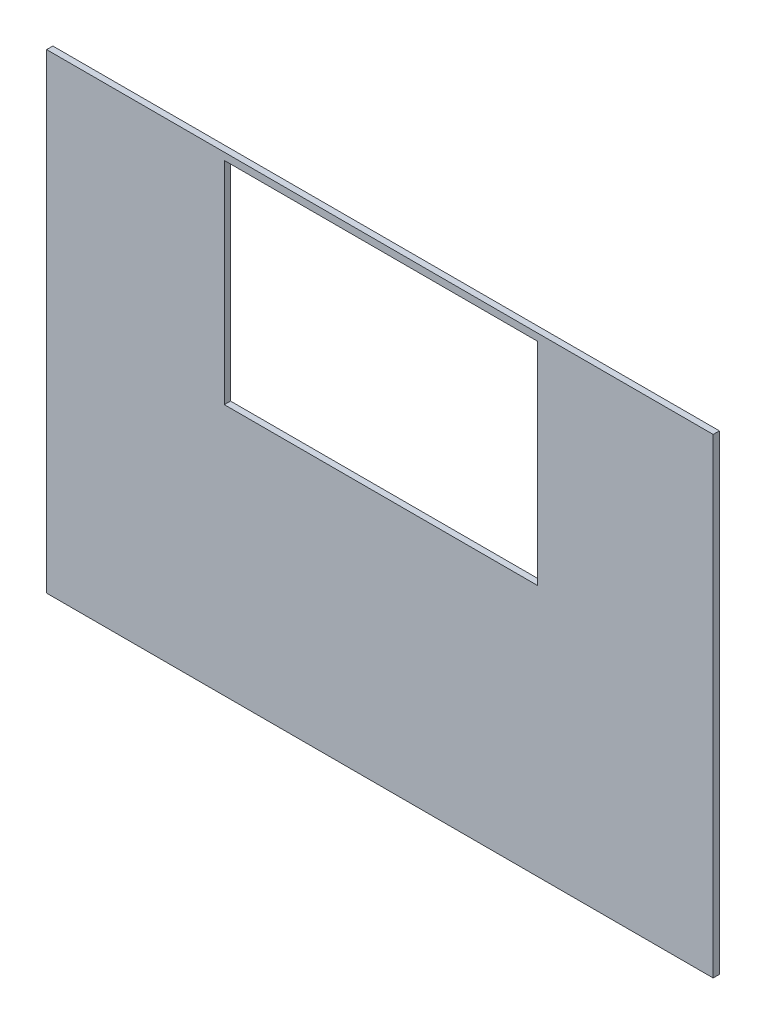
ISO-10303-21;
HEADER;
FILE_DESCRIPTION(('STEP AP214'),'2;1');
FILE_NAME('part.step','',(''),(''),'','','');
FILE_SCHEMA(('AUTOMOTIVE_DESIGN { 1 0 10303 214 1 1 1 1 }'));
ENDSEC;
DATA;
#1=APPLICATION_CONTEXT('core data for automotive mechanical design processes');
#2=APPLICATION_PROTOCOL_DEFINITION('international standard','automotive_design',2000,#1);
#3=PRODUCT_CONTEXT('',#1,'mechanical');
#4=PRODUCT('Part','Part','',(#3));
#5=PRODUCT_RELATED_PRODUCT_CATEGORY('part','',(#4));
#6=PRODUCT_DEFINITION_FORMATION('','',#4);
#7=PRODUCT_DEFINITION_CONTEXT('part definition',#1,'design');
#8=PRODUCT_DEFINITION('design','',#6,#7);
#9=PRODUCT_DEFINITION_SHAPE('','',#8);
#10=(LENGTH_UNIT() NAMED_UNIT(*) SI_UNIT(.MILLI.,.METRE.));
#11=(NAMED_UNIT(*) PLANE_ANGLE_UNIT() SI_UNIT($,.RADIAN.));
#12=(NAMED_UNIT(*) SI_UNIT($,.STERADIAN.) SOLID_ANGLE_UNIT());
#13=UNCERTAINTY_MEASURE_WITH_UNIT(LENGTH_MEASURE(1.E-05),#10,'distance_accuracy_value','');
#14=(GEOMETRIC_REPRESENTATION_CONTEXT(3) GLOBAL_UNCERTAINTY_ASSIGNED_CONTEXT((#13)) GLOBAL_UNIT_ASSIGNED_CONTEXT((#10,
#11,#12)) REPRESENTATION_CONTEXT('',''));
#15=CARTESIAN_POINT('',(0.,0.,0.));
#16=DIRECTION('',(0.,0.,1.));
#17=DIRECTION('',(1.,0.,0.));
#18=AXIS2_PLACEMENT_3D('',#15,#16,#17);
#19=CARTESIAN_POINT('',(0.,0.,6.35));
#20=DIRECTION('',(1.,0.,0.));
#21=DIRECTION('',(0.,1.,0.));
#22=AXIS2_PLACEMENT_3D('',#19,#20,#21);
#23=PLANE('',#22);
#24=DIRECTION('',(0.,-1.,0.));
#25=VECTOR('',#24,1.);
#26=CARTESIAN_POINT('',(0.,0.,0.));
#27=LINE('',#26,#25);
#28=CARTESIAN_POINT('',(0.,0.,0.));
#29=VERTEX_POINT('',#28);
#30=CARTESIAN_POINT('',(0.,-481.00261168,0.));
#31=VERTEX_POINT('',#30);
#32=EDGE_CURVE('E137',#29,#31,#27,.T.);
#33=ORIENTED_EDGE('',*,*,#32,.T.);
#34=DIRECTION('',(0.,0.,-1.));
#35=VECTOR('',#34,1.);
#36=CARTESIAN_POINT('',(0.,-481.00261168,6.35));
#37=LINE('',#36,#35);
#38=CARTESIAN_POINT('',(0.,-481.00261168,6.35));
#39=VERTEX_POINT('',#38);
#40=EDGE_CURVE('E11',#39,#31,#37,.T.);
#41=ORIENTED_EDGE('',*,*,#40,.F.);
#42=DIRECTION('',(0.,-1.,0.));
#43=VECTOR('',#42,1.);
#44=CARTESIAN_POINT('',(0.,0.,6.35));
#45=LINE('',#44,#43);
#46=CARTESIAN_POINT('',(0.,0.,6.35));
#47=VERTEX_POINT('',#46);
#48=EDGE_CURVE('E140',#47,#39,#45,.T.);
#49=ORIENTED_EDGE('',*,*,#48,.F.);
#50=DIRECTION('',(0.,0.,-1.));
#51=VECTOR('',#50,1.);
#52=CARTESIAN_POINT('',(0.,0.,6.35));
#53=LINE('',#52,#51);
#54=EDGE_CURVE('E149',#47,#29,#53,.T.);
#55=ORIENTED_EDGE('',*,*,#54,.T.);
#56=EDGE_LOOP('',(#33,#41,#49,#55));
#57=FACE_BOUND('',#56,.T.);
#58=ADVANCED_FACE('F39',(#57),#23,.F.);
#59=CARTESIAN_POINT('',(0.,-481.00261168,6.35));
#60=DIRECTION('',(0.,1.,0.));
#61=DIRECTION('',(0.,0.,1.));
#62=AXIS2_PLACEMENT_3D('',#59,#60,#61);
#63=PLANE('',#62);
#64=DIRECTION('',(1.,0.,0.));
#65=VECTOR('',#64,1.);
#66=CARTESIAN_POINT('',(0.,-481.00261168,0.));
#67=LINE('',#66,#65);
#68=CARTESIAN_POINT('',(681.08,-481.00261168,0.));
#69=VERTEX_POINT('',#68);
#70=EDGE_CURVE('E155',#31,#69,#67,.T.);
#71=ORIENTED_EDGE('',*,*,#70,.T.);
#72=DIRECTION('',(0.,0.,-1.));
#73=VECTOR('',#72,1.);
#74=CARTESIAN_POINT('',(681.08,-481.00261168,6.35));
#75=LINE('',#74,#73);
#76=CARTESIAN_POINT('',(681.08,-481.00261168,6.35));
#77=VERTEX_POINT('',#76);
#78=EDGE_CURVE('E46',#77,#69,#75,.T.);
#79=ORIENTED_EDGE('',*,*,#78,.F.);
#80=DIRECTION('',(1.,0.,0.));
#81=VECTOR('',#80,1.);
#82=CARTESIAN_POINT('',(0.,-481.00261168,6.35));
#83=LINE('',#82,#81);
#84=EDGE_CURVE('E142',#39,#77,#83,.T.);
#85=ORIENTED_EDGE('',*,*,#84,.F.);
#86=ORIENTED_EDGE('',*,*,#40,.T.);
#87=EDGE_LOOP('',(#71,#79,#85,#86));
#88=FACE_BOUND('',#87,.T.);
#89=ADVANCED_FACE('F176',(#88),#63,.F.);
#90=CARTESIAN_POINT('',(681.08,0.,6.35));
#91=DIRECTION('',(-1.,0.,0.));
#92=DIRECTION('',(0.,0.,1.));
#93=AXIS2_PLACEMENT_3D('',#90,#91,#92);
#94=PLANE('',#93);
#95=DIRECTION('',(0.,1.,0.));
#96=VECTOR('',#95,1.);
#97=CARTESIAN_POINT('',(681.08,0.,0.));
#98=LINE('',#97,#96);
#99=CARTESIAN_POINT('',(681.08,0.,0.));
#100=VERTEX_POINT('',#99);
#101=EDGE_CURVE('E152',#69,#100,#98,.T.);
#102=ORIENTED_EDGE('',*,*,#101,.T.);
#103=DIRECTION('',(0.,0.,-1.));
#104=VECTOR('',#103,1.);
#105=CARTESIAN_POINT('',(681.08,0.,6.35));
#106=LINE('',#105,#104);
#107=CARTESIAN_POINT('',(681.08,0.,6.35));
#108=VERTEX_POINT('',#107);
#109=EDGE_CURVE('E157',#108,#100,#106,.T.);
#110=ORIENTED_EDGE('',*,*,#109,.F.);
#111=DIRECTION('',(0.,1.,0.));
#112=VECTOR('',#111,1.);
#113=CARTESIAN_POINT('',(681.08,0.,6.35));
#114=LINE('',#113,#112);
#115=EDGE_CURVE('E144',#77,#108,#114,.T.);
#116=ORIENTED_EDGE('',*,*,#115,.F.);
#117=ORIENTED_EDGE('',*,*,#78,.T.);
#118=EDGE_LOOP('',(#102,#110,#116,#117));
#119=FACE_BOUND('',#118,.T.);
#120=ADVANCED_FACE('F167',(#119),#94,.F.);
#121=CARTESIAN_POINT('',(0.,0.,6.35));
#122=DIRECTION('',(0.,-1.,0.));
#123=DIRECTION('',(0.,0.,-1.));
#124=AXIS2_PLACEMENT_3D('',#121,#122,#123);
#125=PLANE('',#124);
#126=DIRECTION('',(-1.,0.,0.));
#127=VECTOR('',#126,1.);
#128=CARTESIAN_POINT('',(0.,0.,0.));
#129=LINE('',#128,#127);
#130=EDGE_CURVE('E141',#100,#29,#129,.T.);
#131=ORIENTED_EDGE('',*,*,#130,.T.);
#132=ORIENTED_EDGE('',*,*,#54,.F.);
#133=DIRECTION('',(-1.,0.,0.));
#134=VECTOR('',#133,1.);
#135=CARTESIAN_POINT('',(0.,0.,6.35));
#136=LINE('',#135,#134);
#137=EDGE_CURVE('E150',#108,#47,#136,.T.);
#138=ORIENTED_EDGE('',*,*,#137,.F.);
#139=ORIENTED_EDGE('',*,*,#109,.T.);
#140=EDGE_LOOP('',(#131,#132,#138,#139));
#141=FACE_BOUND('',#140,.T.);
#142=ADVANCED_FACE('F175',(#141),#125,.F.);
#143=CARTESIAN_POINT('',(0.,0.,6.35));
#144=DIRECTION('',(0.,0.,1.));
#145=DIRECTION('',(1.,0.,0.));
#146=AXIS2_PLACEMENT_3D('',#143,#144,#145);
#147=PLANE('',#146);
#148=DIRECTION('',(0.,1.,0.));
#149=VECTOR('',#148,1.);
#150=CARTESIAN_POINT('',(501.388067827174,0.,6.35));
#151=LINE('',#150,#149);
#152=CARTESIAN_POINT('',(501.388067827174,-223.408905389972,6.35));
#153=VERTEX_POINT('',#152);
#154=CARTESIAN_POINT('',(501.388067827174,-7.29535348127616,6.35));
#155=VERTEX_POINT('',#154);
#156=EDGE_CURVE('E138',#153,#155,#151,.T.);
#157=ORIENTED_EDGE('',*,*,#156,.F.);
#158=DIRECTION('',(1.,0.,0.));
#159=VECTOR('',#158,1.);
#160=CARTESIAN_POINT('',(0.,-223.408905389972,6.35));
#161=LINE('',#160,#159);
#162=CARTESIAN_POINT('',(181.541844414339,-223.408905389972,6.35));
#163=VERTEX_POINT('',#162);
#164=EDGE_CURVE('E129',#163,#153,#161,.T.);
#165=ORIENTED_EDGE('',*,*,#164,.F.);
#166=DIRECTION('',(0.,-1.,0.));
#167=VECTOR('',#166,1.);
#168=CARTESIAN_POINT('',(181.541844414339,0.,6.35));
#169=LINE('',#168,#167);
#170=CARTESIAN_POINT('',(181.541844414339,-7.29535348127616,6.35));
#171=VERTEX_POINT('',#170);
#172=EDGE_CURVE('E108',#171,#163,#169,.T.);
#173=ORIENTED_EDGE('',*,*,#172,.F.);
#174=DIRECTION('',(-1.,0.,0.));
#175=VECTOR('',#174,1.);
#176=CARTESIAN_POINT('',(0.,-7.29535348127616,6.35));
#177=LINE('',#176,#175);
#178=EDGE_CURVE('E131',#155,#171,#177,.T.);
#179=ORIENTED_EDGE('',*,*,#178,.F.);
#180=EDGE_LOOP('',(#157,#165,#173,#179));
#181=FACE_BOUND('',#180,.T.);
#182=ORIENTED_EDGE('',*,*,#48,.T.);
#183=ORIENTED_EDGE('',*,*,#84,.T.);
#184=ORIENTED_EDGE('',*,*,#115,.T.);
#185=ORIENTED_EDGE('',*,*,#137,.T.);
#186=EDGE_LOOP('',(#182,#183,#184,#185));
#187=FACE_BOUND('',#186,.T.);
#188=ADVANCED_FACE('F180',(#181,#187),#147,.T.);
#189=CARTESIAN_POINT('',(0.,0.,0.));
#190=DIRECTION('',(0.,0.,1.));
#191=DIRECTION('',(1.,0.,0.));
#192=AXIS2_PLACEMENT_3D('',#189,#190,#191);
#193=PLANE('',#192);
#194=DIRECTION('',(-1.,0.,0.));
#195=VECTOR('',#194,1.);
#196=CARTESIAN_POINT('',(501.388067827174,-223.408905389972,0.));
#197=LINE('',#196,#195);
#198=CARTESIAN_POINT('',(501.388067827174,-223.408905389972,0.));
#199=VERTEX_POINT('',#198);
#200=CARTESIAN_POINT('',(181.541844414339,-223.408905389972,0.));
#201=VERTEX_POINT('',#200);
#202=EDGE_CURVE('E113',#199,#201,#197,.T.);
#203=ORIENTED_EDGE('',*,*,#202,.F.);
#204=DIRECTION('',(0.,-1.,0.));
#205=VECTOR('',#204,1.);
#206=CARTESIAN_POINT('',(501.388067827174,-223.408905389972,0.));
#207=LINE('',#206,#205);
#208=CARTESIAN_POINT('',(501.388067827174,-7.29535348127616,0.));
#209=VERTEX_POINT('',#208);
#210=EDGE_CURVE('E62',#209,#199,#207,.T.);
#211=ORIENTED_EDGE('',*,*,#210,.F.);
#212=DIRECTION('',(1.,0.,0.));
#213=VECTOR('',#212,1.);
#214=CARTESIAN_POINT('',(501.388067827174,-7.29535348127616,0.));
#215=LINE('',#214,#213);
#216=CARTESIAN_POINT('',(181.541844414339,-7.29535348127616,0.));
#217=VERTEX_POINT('',#216);
#218=EDGE_CURVE('E124',#217,#209,#215,.T.);
#219=ORIENTED_EDGE('',*,*,#218,.F.);
#220=DIRECTION('',(0.,1.,0.));
#221=VECTOR('',#220,1.);
#222=CARTESIAN_POINT('',(181.541844414339,-223.408905389972,0.));
#223=LINE('',#222,#221);
#224=EDGE_CURVE('E106',#201,#217,#223,.T.);
#225=ORIENTED_EDGE('',*,*,#224,.F.);
#226=EDGE_LOOP('',(#203,#211,#219,#225));
#227=FACE_BOUND('',#226,.T.);
#228=ORIENTED_EDGE('',*,*,#32,.F.);
#229=ORIENTED_EDGE('',*,*,#130,.F.);
#230=ORIENTED_EDGE('',*,*,#101,.F.);
#231=ORIENTED_EDGE('',*,*,#70,.F.);
#232=EDGE_LOOP('',(#228,#229,#230,#231));
#233=FACE_BOUND('',#232,.T.);
#234=ADVANCED_FACE('F116',(#227,#233),#193,.F.);
#235=CARTESIAN_POINT('',(501.388067827174,-223.408905389972,10.));
#236=DIRECTION('',(1.,0.,0.));
#237=DIRECTION('',(0.,0.,-1.));
#238=AXIS2_PLACEMENT_3D('',#235,#236,#237);
#239=PLANE('',#238);
#240=ORIENTED_EDGE('',*,*,#156,.T.);
#241=DIRECTION('',(0.,0.,-1.));
#242=VECTOR('',#241,1.);
#243=CARTESIAN_POINT('',(501.388067827174,-7.29535348127616,10.));
#244=LINE('',#243,#242);
#245=EDGE_CURVE('E130',#155,#209,#244,.T.);
#246=ORIENTED_EDGE('',*,*,#245,.T.);
#247=ORIENTED_EDGE('',*,*,#210,.T.);
#248=DIRECTION('',(0.,0.,-1.));
#249=VECTOR('',#248,1.);
#250=CARTESIAN_POINT('',(501.388067827174,-223.408905389972,10.));
#251=LINE('',#250,#249);
#252=EDGE_CURVE('E115',#153,#199,#251,.T.);
#253=ORIENTED_EDGE('',*,*,#252,.F.);
#254=EDGE_LOOP('',(#240,#246,#247,#253));
#255=FACE_BOUND('',#254,.T.);
#256=ADVANCED_FACE('F194',(#255),#239,.F.);
#257=CARTESIAN_POINT('',(501.388067827174,-7.29535348127616,10.));
#258=DIRECTION('',(0.,1.,0.));
#259=DIRECTION('',(0.,0.,1.));
#260=AXIS2_PLACEMENT_3D('',#257,#258,#259);
#261=PLANE('',#260);
#262=ORIENTED_EDGE('',*,*,#178,.T.);
#263=DIRECTION('',(0.,0.,-1.));
#264=VECTOR('',#263,1.);
#265=CARTESIAN_POINT('',(181.541844414339,-7.29535348127616,10.));
#266=LINE('',#265,#264);
#267=EDGE_CURVE('E112',#171,#217,#266,.T.);
#268=ORIENTED_EDGE('',*,*,#267,.T.);
#269=ORIENTED_EDGE('',*,*,#218,.T.);
#270=ORIENTED_EDGE('',*,*,#245,.F.);
#271=EDGE_LOOP('',(#262,#268,#269,#270));
#272=FACE_BOUND('',#271,.T.);
#273=ADVANCED_FACE('F196',(#272),#261,.F.);
#274=CARTESIAN_POINT('',(181.541844414339,-223.408905389972,10.));
#275=DIRECTION('',(-1.,0.,0.));
#276=DIRECTION('',(0.,0.,1.));
#277=AXIS2_PLACEMENT_3D('',#274,#275,#276);
#278=PLANE('',#277);
#279=ORIENTED_EDGE('',*,*,#172,.T.);
#280=DIRECTION('',(0.,0.,-1.));
#281=VECTOR('',#280,1.);
#282=CARTESIAN_POINT('',(181.541844414339,-223.408905389972,10.));
#283=LINE('',#282,#281);
#284=EDGE_CURVE('E52',#163,#201,#283,.T.);
#285=ORIENTED_EDGE('',*,*,#284,.T.);
#286=ORIENTED_EDGE('',*,*,#224,.T.);
#287=ORIENTED_EDGE('',*,*,#267,.F.);
#288=EDGE_LOOP('',(#279,#285,#286,#287));
#289=FACE_BOUND('',#288,.T.);
#290=ADVANCED_FACE('F103',(#289),#278,.F.);
#291=CARTESIAN_POINT('',(501.388067827174,-223.408905389972,10.));
#292=DIRECTION('',(0.,-1.,0.));
#293=DIRECTION('',(0.,0.,-1.));
#294=AXIS2_PLACEMENT_3D('',#291,#292,#293);
#295=PLANE('',#294);
#296=ORIENTED_EDGE('',*,*,#164,.T.);
#297=ORIENTED_EDGE('',*,*,#252,.T.);
#298=ORIENTED_EDGE('',*,*,#202,.T.);
#299=ORIENTED_EDGE('',*,*,#284,.F.);
#300=EDGE_LOOP('',(#296,#297,#298,#299));
#301=FACE_BOUND('',#300,.T.);
#302=ADVANCED_FACE('F117',(#301),#295,.F.);
#303=CLOSED_SHELL('',(#58,#89,#120,#142,#188,#234,#256,#273,#290,#302));
#304=MANIFOLD_SOLID_BREP('B2',#303);
#305=ADVANCED_BREP_SHAPE_REPRESENTATION('',(#18,#304),#14);
#306=SHAPE_DEFINITION_REPRESENTATION(#9,#305);
ENDSEC;
END-ISO-10303-21;
